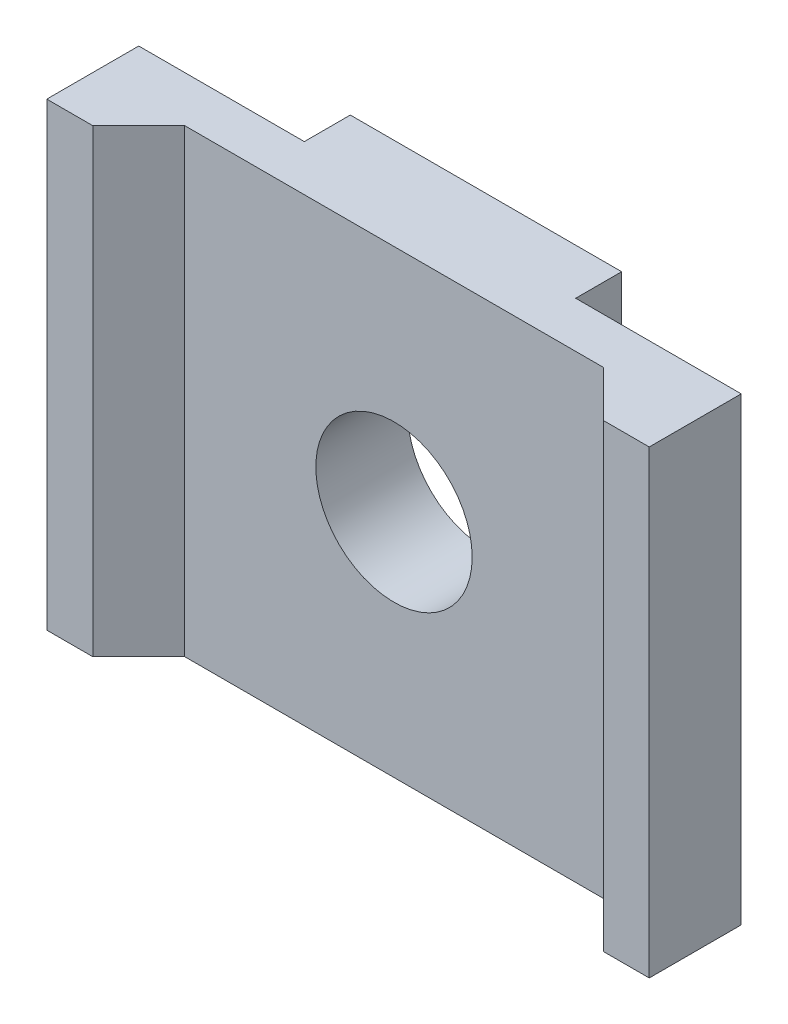
ISO-10303-21;
HEADER;
FILE_DESCRIPTION(('STEP AP214'),'2;1');
FILE_NAME('part.step','',(''),(''),'','','');
FILE_SCHEMA(('AUTOMOTIVE_DESIGN { 1 0 10303 214 1 1 1 1 }'));
ENDSEC;
DATA;
#1=APPLICATION_CONTEXT('core data for automotive mechanical design processes');
#2=APPLICATION_PROTOCOL_DEFINITION('international standard','automotive_design',2000,#1);
#3=PRODUCT_CONTEXT('',#1,'mechanical');
#4=PRODUCT('Part','Part','',(#3));
#5=PRODUCT_RELATED_PRODUCT_CATEGORY('part','',(#4));
#6=PRODUCT_DEFINITION_FORMATION('','',#4);
#7=PRODUCT_DEFINITION_CONTEXT('part definition',#1,'design');
#8=PRODUCT_DEFINITION('design','',#6,#7);
#9=PRODUCT_DEFINITION_SHAPE('','',#8);
#10=(LENGTH_UNIT() NAMED_UNIT(*) SI_UNIT(.MILLI.,.METRE.));
#11=(NAMED_UNIT(*) PLANE_ANGLE_UNIT() SI_UNIT($,.RADIAN.));
#12=(NAMED_UNIT(*) SI_UNIT($,.STERADIAN.) SOLID_ANGLE_UNIT());
#13=UNCERTAINTY_MEASURE_WITH_UNIT(LENGTH_MEASURE(1.E-05),#10,'distance_accuracy_value','');
#14=(GEOMETRIC_REPRESENTATION_CONTEXT(3) GLOBAL_UNCERTAINTY_ASSIGNED_CONTEXT((#13)) GLOBAL_UNIT_ASSIGNED_CONTEXT((#10,
#11,#12)) REPRESENTATION_CONTEXT('',''));
#15=CARTESIAN_POINT('',(0.,0.,0.));
#16=DIRECTION('',(0.,0.,1.));
#17=DIRECTION('',(1.,0.,0.));
#18=AXIS2_PLACEMENT_3D('',#15,#16,#17);
#19=CARTESIAN_POINT('',(-2.95,10.,-2.));
#20=DIRECTION('',(0.,0.,1.));
#21=DIRECTION('',(1.,0.,0.));
#22=AXIS2_PLACEMENT_3D('',#19,#20,#21);
#23=PLANE('',#22);
#24=CARTESIAN_POINT('',(0.,5.,-2.));
#25=DIRECTION('',(0.,0.,1.));
#26=DIRECTION('',(1.,0.,0.));
#27=AXIS2_PLACEMENT_3D('',#24,#25,#26);
#28=CIRCLE('',#27,1.7);
#29=CARTESIAN_POINT('',(1.7,5.,-2.));
#30=VERTEX_POINT('',#29);
#31=EDGE_CURVE('E179',#30,#30,#28,.T.);
#32=ORIENTED_EDGE('',*,*,#31,.T.);
#33=EDGE_LOOP('',(#32));
#34=FACE_BOUND('',#33,.T.);
#35=DIRECTION('',(-1.,0.,0.));
#36=VECTOR('',#35,1.);
#37=CARTESIAN_POINT('',(-2.95,0.,-2.));
#38=LINE('',#37,#36);
#39=CARTESIAN_POINT('',(2.95,0.,-2.));
#40=VERTEX_POINT('',#39);
#41=CARTESIAN_POINT('',(-2.95,0.,-2.));
#42=VERTEX_POINT('',#41);
#43=EDGE_CURVE('E139',#40,#42,#38,.T.);
#44=ORIENTED_EDGE('',*,*,#43,.T.);
#45=DIRECTION('',(0.,-1.,0.));
#46=VECTOR('',#45,1.);
#47=CARTESIAN_POINT('',(-2.95,10.,-2.));
#48=LINE('',#47,#46);
#49=CARTESIAN_POINT('',(-2.95,10.,-2.));
#50=VERTEX_POINT('',#49);
#51=EDGE_CURVE('E11',#50,#42,#48,.T.);
#52=ORIENTED_EDGE('',*,*,#51,.F.);
#53=DIRECTION('',(-1.,0.,0.));
#54=VECTOR('',#53,1.);
#55=CARTESIAN_POINT('',(-2.95,10.,-2.));
#56=LINE('',#55,#54);
#57=CARTESIAN_POINT('',(2.95,10.,-2.));
#58=VERTEX_POINT('',#57);
#59=EDGE_CURVE('E110',#58,#50,#56,.T.);
#60=ORIENTED_EDGE('',*,*,#59,.F.);
#61=DIRECTION('',(0.,-1.,0.));
#62=VECTOR('',#61,1.);
#63=CARTESIAN_POINT('',(2.95,10.,-2.));
#64=LINE('',#63,#62);
#65=EDGE_CURVE('E141',#58,#40,#64,.T.);
#66=ORIENTED_EDGE('',*,*,#65,.T.);
#67=EDGE_LOOP('',(#44,#52,#60,#66));
#68=FACE_BOUND('',#67,.T.);
#69=ADVANCED_FACE('F33',(#34,#68),#23,.F.);
#70=CARTESIAN_POINT('',(-2.95,10.,-0.999999999999999));
#71=DIRECTION('',(1.,0.,0.));
#72=DIRECTION('',(0.,0.,-1.));
#73=AXIS2_PLACEMENT_3D('',#70,#71,#72);
#74=PLANE('',#73);
#75=DIRECTION('',(0.,0.,1.));
#76=VECTOR('',#75,1.);
#77=CARTESIAN_POINT('',(-2.95,0.,-0.999999999999999));
#78=LINE('',#77,#76);
#79=CARTESIAN_POINT('',(-2.95,0.,-0.999999999999999));
#80=VERTEX_POINT('',#79);
#81=EDGE_CURVE('E137',#42,#80,#78,.T.);
#82=ORIENTED_EDGE('',*,*,#81,.T.);
#83=DIRECTION('',(0.,-1.,0.));
#84=VECTOR('',#83,1.);
#85=CARTESIAN_POINT('',(-2.95,10.,-0.999999999999999));
#86=LINE('',#85,#84);
#87=CARTESIAN_POINT('',(-2.95,10.,-0.999999999999999));
#88=VERTEX_POINT('',#87);
#89=EDGE_CURVE('E43',#88,#80,#86,.T.);
#90=ORIENTED_EDGE('',*,*,#89,.F.);
#91=DIRECTION('',(0.,0.,1.));
#92=VECTOR('',#91,1.);
#93=CARTESIAN_POINT('',(-2.95,10.,-0.999999999999999));
#94=LINE('',#93,#92);
#95=EDGE_CURVE('E151',#50,#88,#94,.T.);
#96=ORIENTED_EDGE('',*,*,#95,.F.);
#97=ORIENTED_EDGE('',*,*,#51,.T.);
#98=EDGE_LOOP('',(#82,#90,#96,#97));
#99=FACE_BOUND('',#98,.T.);
#100=ADVANCED_FACE('F254',(#99),#74,.F.);
#101=CARTESIAN_POINT('',(-6.55,10.,-0.999999999999999));
#102=DIRECTION('',(0.,0.,1.));
#103=DIRECTION('',(1.,0.,0.));
#104=AXIS2_PLACEMENT_3D('',#101,#102,#103);
#105=PLANE('',#104);
#106=DIRECTION('',(-1.,0.,0.));
#107=VECTOR('',#106,1.);
#108=CARTESIAN_POINT('',(-6.55,0.,-0.999999999999999));
#109=LINE('',#108,#107);
#110=CARTESIAN_POINT('',(-6.55,0.,-0.999999999999999));
#111=VERTEX_POINT('',#110);
#112=EDGE_CURVE('E135',#80,#111,#109,.T.);
#113=ORIENTED_EDGE('',*,*,#112,.T.);
#114=DIRECTION('',(0.,-1.,0.));
#115=VECTOR('',#114,1.);
#116=CARTESIAN_POINT('',(-6.55,10.,-0.999999999999999));
#117=LINE('',#116,#115);
#118=CARTESIAN_POINT('',(-6.55,10.,-0.999999999999999));
#119=VERTEX_POINT('',#118);
#120=EDGE_CURVE('E128',#119,#111,#117,.T.);
#121=ORIENTED_EDGE('',*,*,#120,.F.);
#122=DIRECTION('',(-1.,0.,0.));
#123=VECTOR('',#122,1.);
#124=CARTESIAN_POINT('',(-6.55,10.,-0.999999999999999));
#125=LINE('',#124,#123);
#126=EDGE_CURVE('E148',#88,#119,#125,.T.);
#127=ORIENTED_EDGE('',*,*,#126,.F.);
#128=ORIENTED_EDGE('',*,*,#89,.T.);
#129=EDGE_LOOP('',(#113,#121,#127,#128));
#130=FACE_BOUND('',#129,.T.);
#131=ADVANCED_FACE('F250',(#130),#105,.F.);
#132=CARTESIAN_POINT('',(-6.55,10.,1.));
#133=DIRECTION('',(1.,0.,0.));
#134=DIRECTION('',(0.,0.,-1.));
#135=AXIS2_PLACEMENT_3D('',#132,#133,#134);
#136=PLANE('',#135);
#137=DIRECTION('',(0.,0.,1.));
#138=VECTOR('',#137,1.);
#139=CARTESIAN_POINT('',(-6.55,0.,1.));
#140=LINE('',#139,#138);
#141=CARTESIAN_POINT('',(-6.55,0.,1.));
#142=VERTEX_POINT('',#141);
#143=EDGE_CURVE('E98',#111,#142,#140,.T.);
#144=ORIENTED_EDGE('',*,*,#143,.T.);
#145=DIRECTION('',(0.,-1.,0.));
#146=VECTOR('',#145,1.);
#147=CARTESIAN_POINT('',(-6.55,10.,1.));
#148=LINE('',#147,#146);
#149=CARTESIAN_POINT('',(-6.55,10.,1.));
#150=VERTEX_POINT('',#149);
#151=EDGE_CURVE('E93',#150,#142,#148,.T.);
#152=ORIENTED_EDGE('',*,*,#151,.F.);
#153=DIRECTION('',(0.,0.,1.));
#154=VECTOR('',#153,1.);
#155=CARTESIAN_POINT('',(-6.55,10.,1.));
#156=LINE('',#155,#154);
#157=EDGE_CURVE('E145',#119,#150,#156,.T.);
#158=ORIENTED_EDGE('',*,*,#157,.F.);
#159=ORIENTED_EDGE('',*,*,#120,.T.);
#160=EDGE_LOOP('',(#144,#152,#158,#159));
#161=FACE_BOUND('',#160,.T.);
#162=ADVANCED_FACE('F246',(#161),#136,.F.);
#163=CARTESIAN_POINT('',(-4.55,10.,1.));
#164=DIRECTION('',(0.,0.,-1.));
#165=DIRECTION('',(-1.,0.,0.));
#166=AXIS2_PLACEMENT_3D('',#163,#164,#165);
#167=PLANE('',#166);
#168=DIRECTION('',(1.,0.,0.));
#169=VECTOR('',#168,1.);
#170=CARTESIAN_POINT('',(-4.55,0.,1.));
#171=LINE('',#170,#169);
#172=CARTESIAN_POINT('',(-5.55,0.,1.));
#173=VERTEX_POINT('',#172);
#174=EDGE_CURVE('E87',#142,#173,#171,.T.);
#175=ORIENTED_EDGE('',*,*,#174,.T.);
#176=DIRECTION('',(0.,1.,0.));
#177=VECTOR('',#176,1.);
#178=CARTESIAN_POINT('',(-5.55,10.,1.));
#179=LINE('',#178,#177);
#180=CARTESIAN_POINT('',(-5.55,10.,1.));
#181=VERTEX_POINT('',#180);
#182=EDGE_CURVE('E91',#181,#173,#179,.F.);
#183=ORIENTED_EDGE('',*,*,#182,.F.);
#184=DIRECTION('',(1.,0.,0.));
#185=VECTOR('',#184,1.);
#186=CARTESIAN_POINT('',(-4.55,10.,1.));
#187=LINE('',#186,#185);
#188=EDGE_CURVE('E143',#150,#181,#187,.T.);
#189=ORIENTED_EDGE('',*,*,#188,.F.);
#190=ORIENTED_EDGE('',*,*,#151,.T.);
#191=EDGE_LOOP('',(#175,#183,#189,#190));
#192=FACE_BOUND('',#191,.T.);
#193=ADVANCED_FACE('F89',(#192),#167,.F.);
#194=CARTESIAN_POINT('',(-4.55,10.,0.));
#195=DIRECTION('',(0.707106781186546,0.,0.707106781186549));
#196=DIRECTION('',(0.707106781186549,0.,-0.707106781186546));
#197=AXIS2_PLACEMENT_3D('',#194,#195,#196);
#198=PLANE('',#197);
#199=DIRECTION('',(-0.707106781186549,0.,0.707106781186546));
#200=VECTOR('',#199,1.);
#201=CARTESIAN_POINT('',(-2.27499999999999,0.,-2.275));
#202=LINE('',#201,#200);
#203=CARTESIAN_POINT('',(-4.55,0.,0.));
#204=VERTEX_POINT('',#203);
#205=EDGE_CURVE('E97',#173,#204,#202,.F.);
#206=ORIENTED_EDGE('',*,*,#205,.T.);
#207=DIRECTION('',(0.,-1.,0.));
#208=VECTOR('',#207,1.);
#209=CARTESIAN_POINT('',(-4.55,10.,0.));
#210=LINE('',#209,#208);
#211=CARTESIAN_POINT('',(-4.55,10.,0.));
#212=VERTEX_POINT('',#211);
#213=EDGE_CURVE('E102',#212,#204,#210,.T.);
#214=ORIENTED_EDGE('',*,*,#213,.F.);
#215=DIRECTION('',(-0.707106781186549,0.,0.707106781186546));
#216=VECTOR('',#215,1.);
#217=CARTESIAN_POINT('',(-2.27499999999999,10.,-2.275));
#218=LINE('',#217,#216);
#219=EDGE_CURVE('E37',#181,#212,#218,.F.);
#220=ORIENTED_EDGE('',*,*,#219,.F.);
#221=ORIENTED_EDGE('',*,*,#182,.T.);
#222=EDGE_LOOP('',(#206,#214,#220,#221));
#223=FACE_BOUND('',#222,.T.);
#224=ADVANCED_FACE('F35',(#223),#198,.T.);
#225=CARTESIAN_POINT('',(0.,10.,0.));
#226=DIRECTION('',(0.,0.,-1.));
#227=DIRECTION('',(-1.,0.,0.));
#228=AXIS2_PLACEMENT_3D('',#225,#226,#227);
#229=PLANE('',#228);
#230=CARTESIAN_POINT('',(0.,5.,0.));
#231=DIRECTION('',(0.,0.,1.));
#232=DIRECTION('',(1.,0.,0.));
#233=AXIS2_PLACEMENT_3D('',#230,#231,#232);
#234=CIRCLE('',#233,1.7);
#235=CARTESIAN_POINT('',(1.7,5.,0.));
#236=VERTEX_POINT('',#235);
#237=EDGE_CURVE('E192',#236,#236,#234,.T.);
#238=ORIENTED_EDGE('',*,*,#237,.F.);
#239=EDGE_LOOP('',(#238));
#240=FACE_BOUND('',#239,.T.);
#241=DIRECTION('',(1.,0.,0.));
#242=VECTOR('',#241,1.);
#243=CARTESIAN_POINT('',(0.,0.,0.));
#244=LINE('',#243,#242);
#245=CARTESIAN_POINT('',(4.55,0.,0.));
#246=VERTEX_POINT('',#245);
#247=EDGE_CURVE('E108',#204,#246,#244,.T.);
#248=ORIENTED_EDGE('',*,*,#247,.T.);
#249=DIRECTION('',(0.,-1.,0.));
#250=VECTOR('',#249,1.);
#251=CARTESIAN_POINT('',(4.55,10.,0.));
#252=LINE('',#251,#250);
#253=CARTESIAN_POINT('',(4.55,10.,0.));
#254=VERTEX_POINT('',#253);
#255=EDGE_CURVE('E117',#254,#246,#252,.T.);
#256=ORIENTED_EDGE('',*,*,#255,.F.);
#257=DIRECTION('',(1.,0.,0.));
#258=VECTOR('',#257,1.);
#259=CARTESIAN_POINT('',(0.,10.,0.));
#260=LINE('',#259,#258);
#261=EDGE_CURVE('E132',#212,#254,#260,.T.);
#262=ORIENTED_EDGE('',*,*,#261,.F.);
#263=ORIENTED_EDGE('',*,*,#213,.T.);
#264=EDGE_LOOP('',(#248,#256,#262,#263));
#265=FACE_BOUND('',#264,.T.);
#266=ADVANCED_FACE('F198',(#240,#265),#229,.F.);
#267=CARTESIAN_POINT('',(0.,10.,0.));
#268=DIRECTION('',(0.,-1.,0.));
#269=DIRECTION('',(0.,0.,-1.));
#270=AXIS2_PLACEMENT_3D('',#267,#268,#269);
#271=PLANE('',#270);
#272=ORIENTED_EDGE('',*,*,#261,.T.);
#273=DIRECTION('',(0.707106781186549,0.,0.707106781186546));
#274=VECTOR('',#273,1.);
#275=CARTESIAN_POINT('',(4.55,10.,0.));
#276=LINE('',#275,#274);
#277=CARTESIAN_POINT('',(5.55,10.,1.));
#278=VERTEX_POINT('',#277);
#279=EDGE_CURVE('E118',#278,#254,#276,.F.);
#280=ORIENTED_EDGE('',*,*,#279,.F.);
#281=DIRECTION('',(-1.,0.,0.));
#282=VECTOR('',#281,1.);
#283=CARTESIAN_POINT('',(4.55,10.,1.));
#284=LINE('',#283,#282);
#285=CARTESIAN_POINT('',(6.55,10.,1.));
#286=VERTEX_POINT('',#285);
#287=EDGE_CURVE('E121',#286,#278,#284,.T.);
#288=ORIENTED_EDGE('',*,*,#287,.F.);
#289=DIRECTION('',(0.,0.,1.));
#290=VECTOR('',#289,1.);
#291=CARTESIAN_POINT('',(6.55,10.,1.));
#292=LINE('',#291,#290);
#293=CARTESIAN_POINT('',(6.55,10.,-0.999999999999999));
#294=VERTEX_POINT('',#293);
#295=EDGE_CURVE('E182',#294,#286,#292,.T.);
#296=ORIENTED_EDGE('',*,*,#295,.F.);
#297=DIRECTION('',(1.,0.,0.));
#298=VECTOR('',#297,1.);
#299=CARTESIAN_POINT('',(6.55,10.,-0.999999999999999));
#300=LINE('',#299,#298);
#301=CARTESIAN_POINT('',(2.95,10.,-0.999999999999999));
#302=VERTEX_POINT('',#301);
#303=EDGE_CURVE('E185',#302,#294,#300,.T.);
#304=ORIENTED_EDGE('',*,*,#303,.F.);
#305=DIRECTION('',(0.,0.,1.));
#306=VECTOR('',#305,1.);
#307=CARTESIAN_POINT('',(2.95,10.,-0.999999999999999));
#308=LINE('',#307,#306);
#309=EDGE_CURVE('E123',#58,#302,#308,.T.);
#310=ORIENTED_EDGE('',*,*,#309,.F.);
#311=ORIENTED_EDGE('',*,*,#59,.T.);
#312=ORIENTED_EDGE('',*,*,#95,.T.);
#313=ORIENTED_EDGE('',*,*,#126,.T.);
#314=ORIENTED_EDGE('',*,*,#157,.T.);
#315=ORIENTED_EDGE('',*,*,#188,.T.);
#316=ORIENTED_EDGE('',*,*,#219,.T.);
#317=EDGE_LOOP('',(#272,#280,#288,#296,#304,#310,#311,#312,#313,#314,#315,#316));
#318=FACE_BOUND('',#317,.T.);
#319=ADVANCED_FACE('F201',(#318),#271,.F.);
#320=CARTESIAN_POINT('',(0.,0.,0.));
#321=DIRECTION('',(0.,-1.,0.));
#322=DIRECTION('',(0.,0.,-1.));
#323=AXIS2_PLACEMENT_3D('',#320,#321,#322);
#324=PLANE('',#323);
#325=ORIENTED_EDGE('',*,*,#43,.F.);
#326=DIRECTION('',(0.,0.,1.));
#327=VECTOR('',#326,1.);
#328=CARTESIAN_POINT('',(2.95,0.,-0.999999999999999));
#329=LINE('',#328,#327);
#330=CARTESIAN_POINT('',(2.95,0.,-0.999999999999999));
#331=VERTEX_POINT('',#330);
#332=EDGE_CURVE('E176',#40,#331,#329,.T.);
#333=ORIENTED_EDGE('',*,*,#332,.T.);
#334=DIRECTION('',(1.,0.,0.));
#335=VECTOR('',#334,1.);
#336=CARTESIAN_POINT('',(6.55,0.,-0.999999999999999));
#337=LINE('',#336,#335);
#338=CARTESIAN_POINT('',(6.55,0.,-0.999999999999999));
#339=VERTEX_POINT('',#338);
#340=EDGE_CURVE('E173',#331,#339,#337,.T.);
#341=ORIENTED_EDGE('',*,*,#340,.T.);
#342=DIRECTION('',(0.,0.,1.));
#343=VECTOR('',#342,1.);
#344=CARTESIAN_POINT('',(6.55,0.,1.));
#345=LINE('',#344,#343);
#346=CARTESIAN_POINT('',(6.55,0.,1.));
#347=VERTEX_POINT('',#346);
#348=EDGE_CURVE('E170',#339,#347,#345,.T.);
#349=ORIENTED_EDGE('',*,*,#348,.T.);
#350=DIRECTION('',(-1.,0.,0.));
#351=VECTOR('',#350,1.);
#352=CARTESIAN_POINT('',(4.55,0.,1.));
#353=LINE('',#352,#351);
#354=CARTESIAN_POINT('',(5.55,0.,1.));
#355=VERTEX_POINT('',#354);
#356=EDGE_CURVE('E124',#347,#355,#353,.T.);
#357=ORIENTED_EDGE('',*,*,#356,.T.);
#358=DIRECTION('',(0.707106781186549,0.,0.707106781186546));
#359=VECTOR('',#358,1.);
#360=CARTESIAN_POINT('',(4.55,0.,0.));
#361=LINE('',#360,#359);
#362=EDGE_CURVE('E122',#355,#246,#361,.F.);
#363=ORIENTED_EDGE('',*,*,#362,.T.);
#364=ORIENTED_EDGE('',*,*,#247,.F.);
#365=ORIENTED_EDGE('',*,*,#205,.F.);
#366=ORIENTED_EDGE('',*,*,#174,.F.);
#367=ORIENTED_EDGE('',*,*,#143,.F.);
#368=ORIENTED_EDGE('',*,*,#112,.F.);
#369=ORIENTED_EDGE('',*,*,#81,.F.);
#370=EDGE_LOOP('',(#325,#333,#341,#349,#357,#363,#364,#365,#366,#367,#368,#369));
#371=FACE_BOUND('',#370,.T.);
#372=ADVANCED_FACE('F105',(#371),#324,.T.);
#373=CARTESIAN_POINT('',(2.95,10.,-0.999999999999999));
#374=DIRECTION('',(-1.,0.,0.));
#375=DIRECTION('',(0.,0.,-1.));
#376=AXIS2_PLACEMENT_3D('',#373,#374,#375);
#377=PLANE('',#376);
#378=ORIENTED_EDGE('',*,*,#332,.F.);
#379=ORIENTED_EDGE('',*,*,#65,.F.);
#380=ORIENTED_EDGE('',*,*,#309,.T.);
#381=DIRECTION('',(0.,-1.,0.));
#382=VECTOR('',#381,1.);
#383=CARTESIAN_POINT('',(2.95,10.,-0.999999999999999));
#384=LINE('',#383,#382);
#385=EDGE_CURVE('E158',#302,#331,#384,.T.);
#386=ORIENTED_EDGE('',*,*,#385,.T.);
#387=EDGE_LOOP('',(#378,#379,#380,#386));
#388=FACE_BOUND('',#387,.T.);
#389=ADVANCED_FACE('F261',(#388),#377,.F.);
#390=CARTESIAN_POINT('',(6.55,10.,-0.999999999999999));
#391=DIRECTION('',(0.,0.,1.));
#392=DIRECTION('',(-1.,0.,0.));
#393=AXIS2_PLACEMENT_3D('',#390,#391,#392);
#394=PLANE('',#393);
#395=ORIENTED_EDGE('',*,*,#340,.F.);
#396=ORIENTED_EDGE('',*,*,#385,.F.);
#397=ORIENTED_EDGE('',*,*,#303,.T.);
#398=DIRECTION('',(0.,-1.,0.));
#399=VECTOR('',#398,1.);
#400=CARTESIAN_POINT('',(6.55,10.,-0.999999999999999));
#401=LINE('',#400,#399);
#402=EDGE_CURVE('E161',#294,#339,#401,.T.);
#403=ORIENTED_EDGE('',*,*,#402,.T.);
#404=EDGE_LOOP('',(#395,#396,#397,#403));
#405=FACE_BOUND('',#404,.T.);
#406=ADVANCED_FACE('F263',(#405),#394,.F.);
#407=CARTESIAN_POINT('',(6.55,10.,1.));
#408=DIRECTION('',(-1.,0.,0.));
#409=DIRECTION('',(0.,0.,-1.));
#410=AXIS2_PLACEMENT_3D('',#407,#408,#409);
#411=PLANE('',#410);
#412=ORIENTED_EDGE('',*,*,#348,.F.);
#413=ORIENTED_EDGE('',*,*,#402,.F.);
#414=ORIENTED_EDGE('',*,*,#295,.T.);
#415=DIRECTION('',(0.,-1.,0.));
#416=VECTOR('',#415,1.);
#417=CARTESIAN_POINT('',(6.55,10.,1.));
#418=LINE('',#417,#416);
#419=EDGE_CURVE('E116',#286,#347,#418,.T.);
#420=ORIENTED_EDGE('',*,*,#419,.T.);
#421=EDGE_LOOP('',(#412,#413,#414,#420));
#422=FACE_BOUND('',#421,.T.);
#423=ADVANCED_FACE('F218',(#422),#411,.F.);
#424=CARTESIAN_POINT('',(4.55,10.,1.));
#425=DIRECTION('',(0.,0.,-1.));
#426=DIRECTION('',(1.,0.,0.));
#427=AXIS2_PLACEMENT_3D('',#424,#425,#426);
#428=PLANE('',#427);
#429=ORIENTED_EDGE('',*,*,#356,.F.);
#430=ORIENTED_EDGE('',*,*,#419,.F.);
#431=ORIENTED_EDGE('',*,*,#287,.T.);
#432=DIRECTION('',(0.,1.,0.));
#433=VECTOR('',#432,1.);
#434=CARTESIAN_POINT('',(5.55,10.,1.));
#435=LINE('',#434,#433);
#436=EDGE_CURVE('E113',#278,#355,#435,.F.);
#437=ORIENTED_EDGE('',*,*,#436,.T.);
#438=EDGE_LOOP('',(#429,#430,#431,#437));
#439=FACE_BOUND('',#438,.T.);
#440=ADVANCED_FACE('F214',(#439),#428,.F.);
#441=CARTESIAN_POINT('',(4.55,10.,0.));
#442=DIRECTION('',(-0.707106781186546,0.,0.707106781186549));
#443=DIRECTION('',(0.707106781186549,0.,0.707106781186546));
#444=AXIS2_PLACEMENT_3D('',#441,#442,#443);
#445=PLANE('',#444);
#446=ORIENTED_EDGE('',*,*,#362,.F.);
#447=ORIENTED_EDGE('',*,*,#436,.F.);
#448=ORIENTED_EDGE('',*,*,#279,.T.);
#449=ORIENTED_EDGE('',*,*,#255,.T.);
#450=EDGE_LOOP('',(#446,#447,#448,#449));
#451=FACE_BOUND('',#450,.T.);
#452=ADVANCED_FACE('F208',(#451),#445,.T.);
#453=CARTESIAN_POINT('',(0.,5.,0.));
#454=DIRECTION('',(0.,0.,1.));
#455=DIRECTION('',(1.,0.,0.));
#456=AXIS2_PLACEMENT_3D('',#453,#454,#455);
#457=CYLINDRICAL_SURFACE('',#456,1.7);
#458=ORIENTED_EDGE('',*,*,#31,.F.);
#459=EDGE_LOOP('',(#458));
#460=FACE_BOUND('',#459,.T.);
#461=ORIENTED_EDGE('',*,*,#237,.T.);
#462=EDGE_LOOP('',(#461));
#463=FACE_BOUND('',#462,.T.);
#464=ADVANCED_FACE('F196',(#460,#463),#457,.F.);
#465=CLOSED_SHELL('',(#69,#100,#131,#162,#193,#224,#266,#319,#372,#389,#406,#423,#440,#452,#464));
#466=MANIFOLD_SOLID_BREP('B2',#465);
#467=ADVANCED_BREP_SHAPE_REPRESENTATION('',(#18,#466),#14);
#468=SHAPE_DEFINITION_REPRESENTATION(#9,#467);
ENDSEC;
END-ISO-10303-21;
